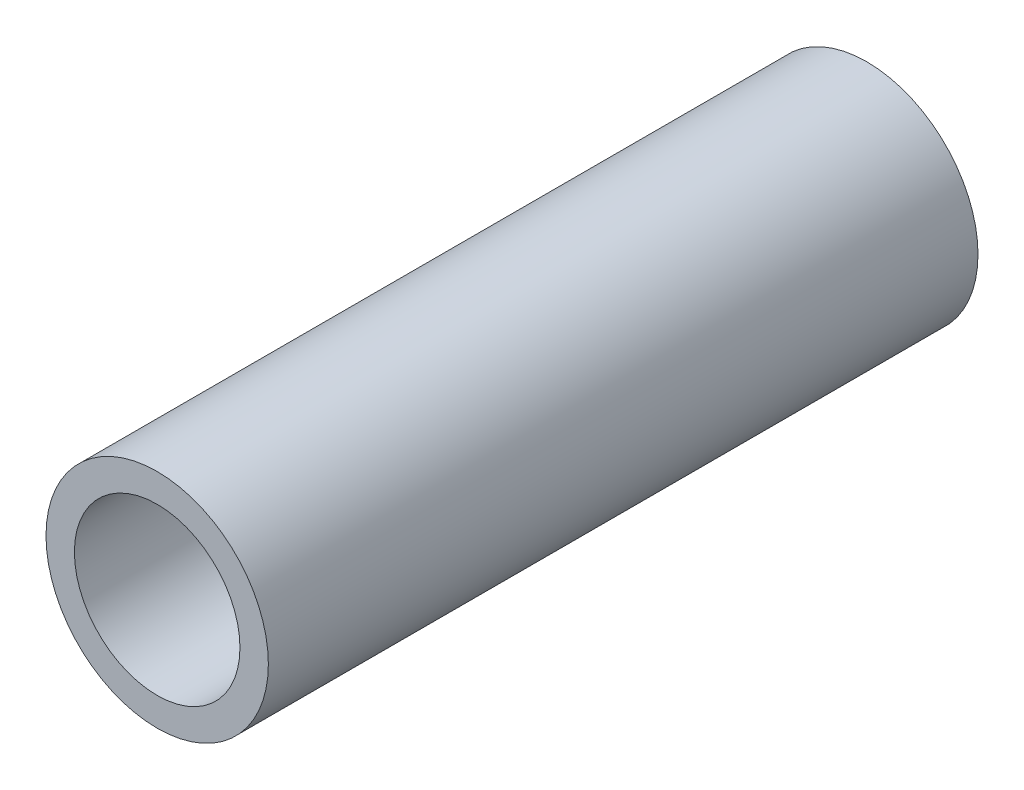
ISO-10303-21;
HEADER;
FILE_DESCRIPTION(('STEP AP214'),'2;1');
FILE_NAME('part.step','',(''),(''),'','','');
FILE_SCHEMA(('AUTOMOTIVE_DESIGN { 1 0 10303 214 1 1 1 1 }'));
ENDSEC;
DATA;
#1=APPLICATION_CONTEXT('core data for automotive mechanical design processes');
#2=APPLICATION_PROTOCOL_DEFINITION('international standard','automotive_design',2000,#1);
#3=PRODUCT_CONTEXT('',#1,'mechanical');
#4=PRODUCT('Part','Part','',(#3));
#5=PRODUCT_RELATED_PRODUCT_CATEGORY('part','',(#4));
#6=PRODUCT_DEFINITION_FORMATION('','',#4);
#7=PRODUCT_DEFINITION_CONTEXT('part definition',#1,'design');
#8=PRODUCT_DEFINITION('design','',#6,#7);
#9=PRODUCT_DEFINITION_SHAPE('','',#8);
#10=(LENGTH_UNIT() NAMED_UNIT(*) SI_UNIT(.MILLI.,.METRE.));
#11=(NAMED_UNIT(*) PLANE_ANGLE_UNIT() SI_UNIT($,.RADIAN.));
#12=(NAMED_UNIT(*) SI_UNIT($,.STERADIAN.) SOLID_ANGLE_UNIT());
#13=UNCERTAINTY_MEASURE_WITH_UNIT(LENGTH_MEASURE(1.E-05),#10,'distance_accuracy_value','');
#14=(GEOMETRIC_REPRESENTATION_CONTEXT(3) GLOBAL_UNCERTAINTY_ASSIGNED_CONTEXT((#13)) GLOBAL_UNIT_ASSIGNED_CONTEXT((#10,
#11,#12)) REPRESENTATION_CONTEXT('',''));
#15=CARTESIAN_POINT('',(0.,0.,0.));
#16=DIRECTION('',(0.,0.,1.));
#17=DIRECTION('',(1.,0.,0.));
#18=AXIS2_PLACEMENT_3D('',#15,#16,#17);
#19=CARTESIAN_POINT('',(0.,0.,38.1));
#20=DIRECTION('',(0.,0.,-1.));
#21=DIRECTION('',(-1.,0.,0.));
#22=AXIS2_PLACEMENT_3D('',#19,#20,#21);
#23=CYLINDRICAL_SURFACE('',#22,5.969);
#24=CARTESIAN_POINT('',(0.,0.,38.1));
#25=DIRECTION('',(0.,0.,1.));
#26=DIRECTION('',(1.,0.,0.));
#27=AXIS2_PLACEMENT_3D('',#24,#25,#26);
#28=CIRCLE('',#27,5.969);
#29=CARTESIAN_POINT('',(5.969,0.,38.1));
#30=VERTEX_POINT('',#29);
#31=EDGE_CURVE('E10',#30,#30,#28,.T.);
#32=ORIENTED_EDGE('',*,*,#31,.F.);
#33=EDGE_LOOP('',(#32));
#34=FACE_BOUND('',#33,.T.);
#35=CARTESIAN_POINT('',(0.,0.,0.));
#36=DIRECTION('',(0.,0.,1.));
#37=DIRECTION('',(1.,0.,0.));
#38=AXIS2_PLACEMENT_3D('',#35,#36,#37);
#39=CIRCLE('',#38,5.969);
#40=CARTESIAN_POINT('',(5.969,0.,0.));
#41=VERTEX_POINT('',#40);
#42=EDGE_CURVE('E38',#41,#41,#39,.T.);
#43=ORIENTED_EDGE('',*,*,#42,.T.);
#44=EDGE_LOOP('',(#43));
#45=FACE_BOUND('',#44,.T.);
#46=ADVANCED_FACE('F35',(#34,#45),#23,.T.);
#47=CARTESIAN_POINT('',(0.,0.,38.1));
#48=DIRECTION('',(0.,0.,1.));
#49=DIRECTION('',(1.,0.,0.));
#50=AXIS2_PLACEMENT_3D('',#47,#48,#49);
#51=PLANE('',#50);
#52=CARTESIAN_POINT('',(0.,0.,38.1));
#53=DIRECTION('',(0.,0.,1.));
#54=DIRECTION('',(1.,0.,0.));
#55=AXIS2_PLACEMENT_3D('',#52,#53,#54);
#56=CIRCLE('',#55,4.445);
#57=CARTESIAN_POINT('',(4.445,0.,38.1));
#58=VERTEX_POINT('',#57);
#59=EDGE_CURVE('E50',#58,#58,#56,.T.);
#60=ORIENTED_EDGE('',*,*,#59,.F.);
#61=EDGE_LOOP('',(#60));
#62=FACE_BOUND('',#61,.T.);
#63=ORIENTED_EDGE('',*,*,#31,.T.);
#64=EDGE_LOOP('',(#63));
#65=FACE_BOUND('',#64,.T.);
#66=ADVANCED_FACE('F68',(#62,#65),#51,.T.);
#67=CARTESIAN_POINT('',(0.,0.,0.));
#68=DIRECTION('',(0.,0.,1.));
#69=DIRECTION('',(1.,0.,0.));
#70=AXIS2_PLACEMENT_3D('',#67,#68,#69);
#71=PLANE('',#70);
#72=CARTESIAN_POINT('',(0.,0.,0.));
#73=DIRECTION('',(0.,0.,1.));
#74=DIRECTION('',(1.,0.,0.));
#75=AXIS2_PLACEMENT_3D('',#72,#73,#74);
#76=CIRCLE('',#75,4.445);
#77=CARTESIAN_POINT('',(4.445,0.,0.));
#78=VERTEX_POINT('',#77);
#79=EDGE_CURVE('E48',#78,#78,#76,.T.);
#80=ORIENTED_EDGE('',*,*,#79,.T.);
#81=EDGE_LOOP('',(#80));
#82=FACE_BOUND('',#81,.T.);
#83=ORIENTED_EDGE('',*,*,#42,.F.);
#84=EDGE_LOOP('',(#83));
#85=FACE_BOUND('',#84,.T.);
#86=ADVANCED_FACE('F59',(#82,#85),#71,.F.);
#87=CARTESIAN_POINT('',(0.,0.,0.));
#88=DIRECTION('',(0.,0.,1.));
#89=DIRECTION('',(1.,0.,0.));
#90=AXIS2_PLACEMENT_3D('',#87,#88,#89);
#91=CYLINDRICAL_SURFACE('',#90,4.445);
#92=ORIENTED_EDGE('',*,*,#79,.F.);
#93=EDGE_LOOP('',(#92));
#94=FACE_BOUND('',#93,.T.);
#95=ORIENTED_EDGE('',*,*,#59,.T.);
#96=EDGE_LOOP('',(#95));
#97=FACE_BOUND('',#96,.T.);
#98=ADVANCED_FACE('F62',(#94,#97),#91,.F.);
#99=CLOSED_SHELL('',(#46,#66,#86,#98));
#100=MANIFOLD_SOLID_BREP('B2',#99);
#101=ADVANCED_BREP_SHAPE_REPRESENTATION('',(#18,#100),#14);
#102=SHAPE_DEFINITION_REPRESENTATION(#9,#101);
ENDSEC;
END-ISO-10303-21;
